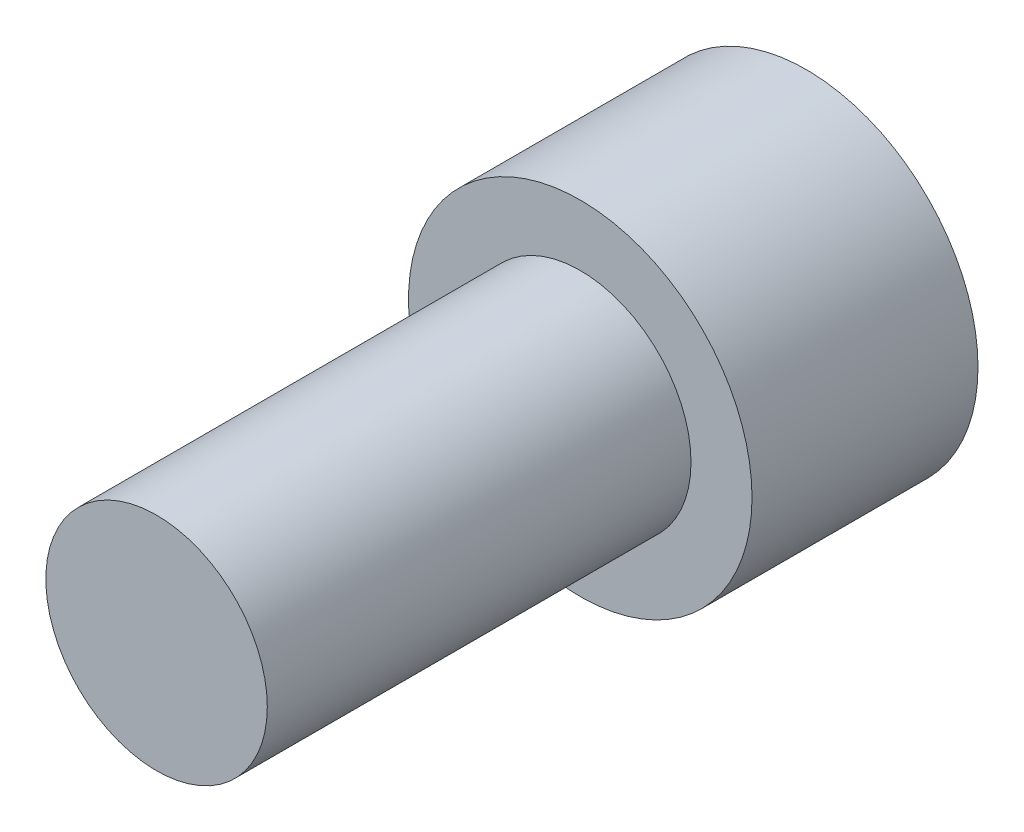
ISO-10303-21;
HEADER;
FILE_DESCRIPTION(('STEP AP214'),'2;1');
FILE_NAME('part.step','',(''),(''),'','','');
FILE_SCHEMA(('AUTOMOTIVE_DESIGN { 1 0 10303 214 1 1 1 1 }'));
ENDSEC;
DATA;
#1=APPLICATION_CONTEXT('core data for automotive mechanical design processes');
#2=APPLICATION_PROTOCOL_DEFINITION('international standard','automotive_design',2000,#1);
#3=PRODUCT_CONTEXT('',#1,'mechanical');
#4=PRODUCT('Part','Part','',(#3));
#5=PRODUCT_RELATED_PRODUCT_CATEGORY('part','',(#4));
#6=PRODUCT_DEFINITION_FORMATION('','',#4);
#7=PRODUCT_DEFINITION_CONTEXT('part definition',#1,'design');
#8=PRODUCT_DEFINITION('design','',#6,#7);
#9=PRODUCT_DEFINITION_SHAPE('','',#8);
#10=(LENGTH_UNIT() NAMED_UNIT(*) SI_UNIT(.MILLI.,.METRE.));
#11=(NAMED_UNIT(*) PLANE_ANGLE_UNIT() SI_UNIT($,.RADIAN.));
#12=(NAMED_UNIT(*) SI_UNIT($,.STERADIAN.) SOLID_ANGLE_UNIT());
#13=UNCERTAINTY_MEASURE_WITH_UNIT(LENGTH_MEASURE(1.E-05),#10,'distance_accuracy_value','');
#14=(GEOMETRIC_REPRESENTATION_CONTEXT(3) GLOBAL_UNCERTAINTY_ASSIGNED_CONTEXT((#13)) GLOBAL_UNIT_ASSIGNED_CONTEXT((#10,
#11,#12)) REPRESENTATION_CONTEXT('',''));
#15=CARTESIAN_POINT('',(0.,0.,0.));
#16=DIRECTION('',(0.,0.,1.));
#17=DIRECTION('',(1.,0.,0.));
#18=AXIS2_PLACEMENT_3D('',#15,#16,#17);
#19=CARTESIAN_POINT('',(0.,0.,14.605));
#20=DIRECTION('',(0.,0.,-1.));
#21=DIRECTION('',(-1.,0.,0.));
#22=AXIS2_PLACEMENT_3D('',#19,#20,#21);
#23=CYLINDRICAL_SURFACE('',#22,3.8608);
#24=CARTESIAN_POINT('',(0.,0.,0.));
#25=DIRECTION('',(0.,0.,1.));
#26=DIRECTION('',(1.,0.,0.));
#27=AXIS2_PLACEMENT_3D('',#24,#25,#26);
#28=CIRCLE('',#27,3.8608);
#29=CARTESIAN_POINT('',(3.8608,0.,0.));
#30=VERTEX_POINT('',#29);
#31=EDGE_CURVE('E12',#30,#30,#28,.T.);
#32=ORIENTED_EDGE('',*,*,#31,.T.);
#33=EDGE_LOOP('',(#32));
#34=FACE_BOUND('',#33,.T.);
#35=CARTESIAN_POINT('',(0.,0.,5.08));
#36=DIRECTION('',(0.,0.,1.));
#37=DIRECTION('',(1.,0.,0.));
#38=AXIS2_PLACEMENT_3D('',#35,#36,#37);
#39=CIRCLE('',#38,3.8608);
#40=CARTESIAN_POINT('',(3.8608,0.,5.08));
#41=VERTEX_POINT('',#40);
#42=EDGE_CURVE('E41',#41,#41,#39,.T.);
#43=ORIENTED_EDGE('',*,*,#42,.F.);
#44=EDGE_LOOP('',(#43));
#45=FACE_BOUND('',#44,.T.);
#46=ADVANCED_FACE('F38',(#34,#45),#23,.T.);
#47=CARTESIAN_POINT('',(0.,0.,0.));
#48=DIRECTION('',(0.,0.,1.));
#49=DIRECTION('',(1.,0.,0.));
#50=AXIS2_PLACEMENT_3D('',#47,#48,#49);
#51=PLANE('',#50);
#52=DIRECTION('',(0.866025403784438,-0.500000000000001,0.));
#53=VECTOR('',#52,1.);
#54=CARTESIAN_POINT('',(0.,2.98768394834781,0.));
#55=LINE('',#54,#53);
#56=CARTESIAN_POINT('',(0.,2.98768394834781,0.));
#57=VERTEX_POINT('',#56);
#58=CARTESIAN_POINT('',(2.5874101977482,1.4938419741739,0.));
#59=VERTEX_POINT('',#58);
#60=EDGE_CURVE('E126',#57,#59,#55,.T.);
#61=ORIENTED_EDGE('',*,*,#60,.F.);
#62=DIRECTION('',(0.866025403784442,0.499999999999995,0.));
#63=VECTOR('',#62,1.);
#64=CARTESIAN_POINT('',(-2.58741019774818,1.49384197417393,0.));
#65=LINE('',#64,#63);
#66=CARTESIAN_POINT('',(-2.58741019774818,1.49384197417393,0.));
#67=VERTEX_POINT('',#66);
#68=EDGE_CURVE('E52',#67,#57,#65,.T.);
#69=ORIENTED_EDGE('',*,*,#68,.F.);
#70=DIRECTION('',(0.,1.,0.));
#71=VECTOR('',#70,1.);
#72=CARTESIAN_POINT('',(-2.58741019774821,-1.49384197417388,0.));
#73=LINE('',#72,#71);
#74=CARTESIAN_POINT('',(-2.58741019774821,-1.49384197417388,0.));
#75=VERTEX_POINT('',#74);
#76=EDGE_CURVE('E135',#75,#67,#73,.T.);
#77=ORIENTED_EDGE('',*,*,#76,.F.);
#78=DIRECTION('',(-0.866025403784434,0.500000000000007,0.));
#79=VECTOR('',#78,1.);
#80=CARTESIAN_POINT('',(0.,-2.98768394834781,0.));
#81=LINE('',#80,#79);
#82=CARTESIAN_POINT('',(0.,-2.98768394834781,0.));
#83=VERTEX_POINT('',#82);
#84=EDGE_CURVE('E133',#83,#75,#81,.T.);
#85=ORIENTED_EDGE('',*,*,#84,.F.);
#86=DIRECTION('',(-0.866025403784442,-0.499999999999995,0.));
#87=VECTOR('',#86,1.);
#88=CARTESIAN_POINT('',(2.58741019774819,-1.49384197417392,0.));
#89=LINE('',#88,#87);
#90=CARTESIAN_POINT('',(2.58741019774819,-1.49384197417392,0.));
#91=VERTEX_POINT('',#90);
#92=EDGE_CURVE('E100',#91,#83,#89,.T.);
#93=ORIENTED_EDGE('',*,*,#92,.F.);
#94=DIRECTION('',(0.,-1.,0.));
#95=VECTOR('',#94,1.);
#96=CARTESIAN_POINT('',(2.5874101977482,1.4938419741739,0.));
#97=LINE('',#96,#95);
#98=EDGE_CURVE('E129',#59,#91,#97,.T.);
#99=ORIENTED_EDGE('',*,*,#98,.F.);
#100=EDGE_LOOP('',(#61,#69,#77,#85,#93,#99));
#101=FACE_BOUND('',#100,.T.);
#102=ORIENTED_EDGE('',*,*,#31,.F.);
#103=EDGE_LOOP('',(#102));
#104=FACE_BOUND('',#103,.T.);
#105=ADVANCED_FACE('F164',(#101,#104),#51,.F.);
#106=CARTESIAN_POINT('',(0.,0.,5.08));
#107=DIRECTION('',(0.,0.,1.));
#108=DIRECTION('',(1.,0.,0.));
#109=AXIS2_PLACEMENT_3D('',#106,#107,#108);
#110=PLANE('',#109);
#111=CARTESIAN_POINT('',(0.,0.,5.08));
#112=DIRECTION('',(0.,0.,1.));
#113=DIRECTION('',(1.,0.,0.));
#114=AXIS2_PLACEMENT_3D('',#111,#112,#113);
#115=CIRCLE('',#114,2.4892);
#116=CARTESIAN_POINT('',(2.4892,0.,5.08));
#117=VERTEX_POINT('',#116);
#118=EDGE_CURVE('E145',#117,#117,#115,.T.);
#119=ORIENTED_EDGE('',*,*,#118,.F.);
#120=EDGE_LOOP('',(#119));
#121=FACE_BOUND('',#120,.T.);
#122=ORIENTED_EDGE('',*,*,#42,.T.);
#123=EDGE_LOOP('',(#122));
#124=FACE_BOUND('',#123,.T.);
#125=ADVANCED_FACE('F155',(#121,#124),#110,.T.);
#126=CARTESIAN_POINT('',(0.,0.,5.08));
#127=DIRECTION('',(0.,0.,1.));
#128=DIRECTION('',(1.,0.,0.));
#129=AXIS2_PLACEMENT_3D('',#126,#127,#128);
#130=CYLINDRICAL_SURFACE('',#129,2.4892);
#131=ORIENTED_EDGE('',*,*,#118,.T.);
#132=EDGE_LOOP('',(#131));
#133=FACE_BOUND('',#132,.T.);
#134=CARTESIAN_POINT('',(0.,0.,14.605));
#135=DIRECTION('',(0.,0.,1.));
#136=DIRECTION('',(1.,0.,0.));
#137=AXIS2_PLACEMENT_3D('',#134,#135,#136);
#138=CIRCLE('',#137,2.4892);
#139=CARTESIAN_POINT('',(2.4892,0.,14.605));
#140=VERTEX_POINT('',#139);
#141=EDGE_CURVE('E139',#140,#140,#138,.T.);
#142=ORIENTED_EDGE('',*,*,#141,.F.);
#143=EDGE_LOOP('',(#142));
#144=FACE_BOUND('',#143,.T.);
#145=ADVANCED_FACE('F153',(#133,#144),#130,.T.);
#146=CARTESIAN_POINT('',(0.,0.,14.605));
#147=DIRECTION('',(0.,0.,1.));
#148=DIRECTION('',(1.,0.,0.));
#149=AXIS2_PLACEMENT_3D('',#146,#147,#148);
#150=PLANE('',#149);
#151=ORIENTED_EDGE('',*,*,#141,.T.);
#152=EDGE_LOOP('',(#151));
#153=FACE_BOUND('',#152,.T.);
#154=ADVANCED_FACE('F151',(#153),#150,.T.);
#155=CARTESIAN_POINT('',(-2.58741019774818,1.49384197417393,3.048));
#156=DIRECTION('',(-0.499999999999995,0.866025403784442,0.));
#157=DIRECTION('',(-0.866025403784442,-0.499999999999995,0.));
#158=AXIS2_PLACEMENT_3D('',#155,#156,#157);
#159=PLANE('',#158);
#160=ORIENTED_EDGE('',*,*,#68,.T.);
#161=DIRECTION('',(0.,0.,-1.));
#162=VECTOR('',#161,1.);
#163=CARTESIAN_POINT('',(0.,2.98768394834781,3.048));
#164=LINE('',#163,#162);
#165=CARTESIAN_POINT('',(0.,2.98768394834781,3.048));
#166=VERTEX_POINT('',#165);
#167=EDGE_CURVE('E82',#166,#57,#164,.T.);
#168=ORIENTED_EDGE('',*,*,#167,.F.);
#169=DIRECTION('',(0.866025403784442,0.499999999999995,0.));
#170=VECTOR('',#169,1.);
#171=CARTESIAN_POINT('',(-2.58741019774818,1.49384197417393,3.048));
#172=LINE('',#171,#170);
#173=CARTESIAN_POINT('',(-2.58741019774818,1.49384197417393,3.048));
#174=VERTEX_POINT('',#173);
#175=EDGE_CURVE('E137',#174,#166,#172,.T.);
#176=ORIENTED_EDGE('',*,*,#175,.F.);
#177=DIRECTION('',(0.,0.,-1.));
#178=VECTOR('',#177,1.);
#179=CARTESIAN_POINT('',(-2.58741019774818,1.49384197417393,3.048));
#180=LINE('',#179,#178);
#181=EDGE_CURVE('E60',#174,#67,#180,.T.);
#182=ORIENTED_EDGE('',*,*,#181,.T.);
#183=EDGE_LOOP('',(#160,#168,#176,#182));
#184=FACE_BOUND('',#183,.T.);
#185=ADVANCED_FACE('F162',(#184),#159,.F.);
#186=CARTESIAN_POINT('',(-2.58741019774821,-1.49384197417388,3.048));
#187=DIRECTION('',(-1.,0.,0.));
#188=DIRECTION('',(0.,-1.,0.));
#189=AXIS2_PLACEMENT_3D('',#186,#187,#188);
#190=PLANE('',#189);
#191=ORIENTED_EDGE('',*,*,#76,.T.);
#192=ORIENTED_EDGE('',*,*,#181,.F.);
#193=DIRECTION('',(0.,1.,0.));
#194=VECTOR('',#193,1.);
#195=CARTESIAN_POINT('',(-2.58741019774821,-1.49384197417388,3.048));
#196=LINE('',#195,#194);
#197=CARTESIAN_POINT('',(-2.58741019774821,-1.49384197417388,3.048));
#198=VERTEX_POINT('',#197);
#199=EDGE_CURVE('E112',#198,#174,#196,.T.);
#200=ORIENTED_EDGE('',*,*,#199,.F.);
#201=DIRECTION('',(0.,0.,-1.));
#202=VECTOR('',#201,1.);
#203=CARTESIAN_POINT('',(-2.58741019774821,-1.49384197417388,3.048));
#204=LINE('',#203,#202);
#205=EDGE_CURVE('E104',#198,#75,#204,.T.);
#206=ORIENTED_EDGE('',*,*,#205,.T.);
#207=EDGE_LOOP('',(#191,#192,#200,#206));
#208=FACE_BOUND('',#207,.T.);
#209=ADVANCED_FACE('F189',(#208),#190,.F.);
#210=CARTESIAN_POINT('',(0.,-2.98768394834781,3.048));
#211=DIRECTION('',(-0.500000000000007,-0.866025403784435,0.));
#212=DIRECTION('',(0.866025403784435,-0.500000000000007,0.));
#213=AXIS2_PLACEMENT_3D('',#210,#211,#212);
#214=PLANE('',#213);
#215=ORIENTED_EDGE('',*,*,#84,.T.);
#216=ORIENTED_EDGE('',*,*,#205,.F.);
#217=DIRECTION('',(-0.866025403784434,0.500000000000007,0.));
#218=VECTOR('',#217,1.);
#219=CARTESIAN_POINT('',(0.,-2.98768394834781,3.048));
#220=LINE('',#219,#218);
#221=CARTESIAN_POINT('',(0.,-2.98768394834781,3.048));
#222=VERTEX_POINT('',#221);
#223=EDGE_CURVE('E108',#222,#198,#220,.T.);
#224=ORIENTED_EDGE('',*,*,#223,.F.);
#225=DIRECTION('',(0.,0.,-1.));
#226=VECTOR('',#225,1.);
#227=CARTESIAN_POINT('',(0.,-2.98768394834781,3.048));
#228=LINE('',#227,#226);
#229=EDGE_CURVE('E93',#222,#83,#228,.T.);
#230=ORIENTED_EDGE('',*,*,#229,.T.);
#231=EDGE_LOOP('',(#215,#216,#224,#230));
#232=FACE_BOUND('',#231,.T.);
#233=ADVANCED_FACE('F109',(#232),#214,.F.);
#234=CARTESIAN_POINT('',(2.58741019774819,-1.49384197417392,3.048));
#235=DIRECTION('',(0.499999999999995,-0.866025403784442,0.));
#236=DIRECTION('',(0.866025403784442,0.499999999999995,0.));
#237=AXIS2_PLACEMENT_3D('',#234,#235,#236);
#238=PLANE('',#237);
#239=ORIENTED_EDGE('',*,*,#92,.T.);
#240=ORIENTED_EDGE('',*,*,#229,.F.);
#241=DIRECTION('',(-0.866025403784442,-0.499999999999995,0.));
#242=VECTOR('',#241,1.);
#243=CARTESIAN_POINT('',(2.58741019774819,-1.49384197417392,3.048));
#244=LINE('',#243,#242);
#245=CARTESIAN_POINT('',(2.58741019774819,-1.49384197417392,3.048));
#246=VERTEX_POINT('',#245);
#247=EDGE_CURVE('E97',#246,#222,#244,.T.);
#248=ORIENTED_EDGE('',*,*,#247,.F.);
#249=DIRECTION('',(0.,0.,-1.));
#250=VECTOR('',#249,1.);
#251=CARTESIAN_POINT('',(2.58741019774819,-1.49384197417392,3.048));
#252=LINE('',#251,#250);
#253=EDGE_CURVE('E105',#246,#91,#252,.T.);
#254=ORIENTED_EDGE('',*,*,#253,.T.);
#255=EDGE_LOOP('',(#239,#240,#248,#254));
#256=FACE_BOUND('',#255,.T.);
#257=ADVANCED_FACE('F95',(#256),#238,.F.);
#258=CARTESIAN_POINT('',(2.5874101977482,1.4938419741739,3.048));
#259=DIRECTION('',(1.,0.,0.));
#260=DIRECTION('',(0.,1.,0.));
#261=AXIS2_PLACEMENT_3D('',#258,#259,#260);
#262=PLANE('',#261);
#263=ORIENTED_EDGE('',*,*,#98,.T.);
#264=ORIENTED_EDGE('',*,*,#253,.F.);
#265=DIRECTION('',(0.,-1.,0.));
#266=VECTOR('',#265,1.);
#267=CARTESIAN_POINT('',(2.5874101977482,1.4938419741739,3.048));
#268=LINE('',#267,#266);
#269=CARTESIAN_POINT('',(2.5874101977482,1.4938419741739,3.048));
#270=VERTEX_POINT('',#269);
#271=EDGE_CURVE('E118',#270,#246,#268,.T.);
#272=ORIENTED_EDGE('',*,*,#271,.F.);
#273=DIRECTION('',(0.,0.,-1.));
#274=VECTOR('',#273,1.);
#275=CARTESIAN_POINT('',(2.5874101977482,1.4938419741739,3.048));
#276=LINE('',#275,#274);
#277=EDGE_CURVE('E142',#270,#59,#276,.T.);
#278=ORIENTED_EDGE('',*,*,#277,.T.);
#279=EDGE_LOOP('',(#263,#264,#272,#278));
#280=FACE_BOUND('',#279,.T.);
#281=ADVANCED_FACE('F197',(#280),#262,.F.);
#282=CARTESIAN_POINT('',(0.,2.98768394834781,3.048));
#283=DIRECTION('',(0.500000000000001,0.866025403784438,0.));
#284=DIRECTION('',(-0.866025403784438,0.500000000000001,0.));
#285=AXIS2_PLACEMENT_3D('',#282,#283,#284);
#286=PLANE('',#285);
#287=ORIENTED_EDGE('',*,*,#60,.T.);
#288=ORIENTED_EDGE('',*,*,#277,.F.);
#289=DIRECTION('',(0.866025403784438,-0.500000000000001,0.));
#290=VECTOR('',#289,1.);
#291=CARTESIAN_POINT('',(0.,2.98768394834781,3.048));
#292=LINE('',#291,#290);
#293=EDGE_CURVE('E120',#166,#270,#292,.T.);
#294=ORIENTED_EDGE('',*,*,#293,.F.);
#295=ORIENTED_EDGE('',*,*,#167,.T.);
#296=EDGE_LOOP('',(#287,#288,#294,#295));
#297=FACE_BOUND('',#296,.T.);
#298=ADVANCED_FACE('F186',(#297),#286,.F.);
#299=CARTESIAN_POINT('',(0.,2.98768394834781,3.048));
#300=DIRECTION('',(0.,0.,-1.));
#301=DIRECTION('',(-1.,0.,0.));
#302=AXIS2_PLACEMENT_3D('',#299,#300,#301);
#303=PLANE('',#302);
#304=ORIENTED_EDGE('',*,*,#175,.T.);
#305=ORIENTED_EDGE('',*,*,#293,.T.);
#306=ORIENTED_EDGE('',*,*,#271,.T.);
#307=ORIENTED_EDGE('',*,*,#247,.T.);
#308=ORIENTED_EDGE('',*,*,#223,.T.);
#309=ORIENTED_EDGE('',*,*,#199,.T.);
#310=EDGE_LOOP('',(#304,#305,#306,#307,#308,#309));
#311=FACE_BOUND('',#310,.T.);
#312=ADVANCED_FACE('F115',(#311),#303,.T.);
#313=CLOSED_SHELL('',(#46,#105,#125,#145,#154,#185,#209,#233,#257,#281,#298,#312));
#314=MANIFOLD_SOLID_BREP('B2',#313);
#315=ADVANCED_BREP_SHAPE_REPRESENTATION('',(#18,#314),#14);
#316=SHAPE_DEFINITION_REPRESENTATION(#9,#315);
ENDSEC;
END-ISO-10303-21;
